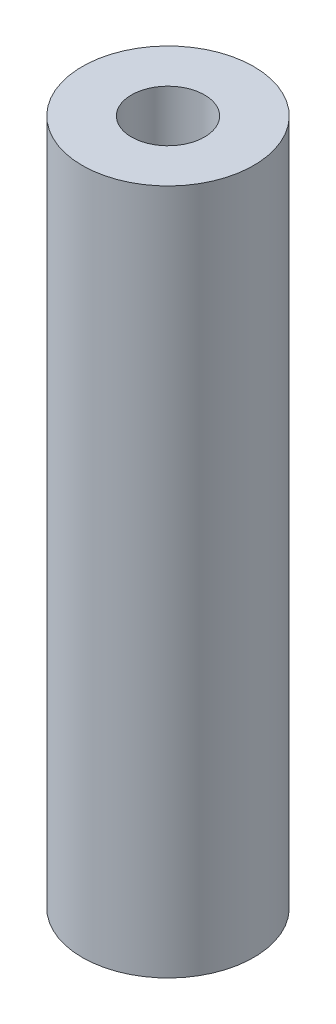
ISO-10303-21;
HEADER;
FILE_DESCRIPTION(('STEP AP214'),'2;1');
FILE_NAME('part.step','',(''),(''),'','','');
FILE_SCHEMA(('AUTOMOTIVE_DESIGN { 1 0 10303 214 1 1 1 1 }'));
ENDSEC;
DATA;
#1=APPLICATION_CONTEXT('core data for automotive mechanical design processes');
#2=APPLICATION_PROTOCOL_DEFINITION('international standard','automotive_design',2000,#1);
#3=PRODUCT_CONTEXT('',#1,'mechanical');
#4=PRODUCT('Part','Part','',(#3));
#5=PRODUCT_RELATED_PRODUCT_CATEGORY('part','',(#4));
#6=PRODUCT_DEFINITION_FORMATION('','',#4);
#7=PRODUCT_DEFINITION_CONTEXT('part definition',#1,'design');
#8=PRODUCT_DEFINITION('design','',#6,#7);
#9=PRODUCT_DEFINITION_SHAPE('','',#8);
#10=(LENGTH_UNIT() NAMED_UNIT(*) SI_UNIT(.MILLI.,.METRE.));
#11=(NAMED_UNIT(*) PLANE_ANGLE_UNIT() SI_UNIT($,.RADIAN.));
#12=(NAMED_UNIT(*) SI_UNIT($,.STERADIAN.) SOLID_ANGLE_UNIT());
#13=UNCERTAINTY_MEASURE_WITH_UNIT(LENGTH_MEASURE(1.E-05),#10,'distance_accuracy_value','');
#14=(GEOMETRIC_REPRESENTATION_CONTEXT(3) GLOBAL_UNCERTAINTY_ASSIGNED_CONTEXT((#13)) GLOBAL_UNIT_ASSIGNED_CONTEXT((#10,
#11,#12)) REPRESENTATION_CONTEXT('',''));
#15=CARTESIAN_POINT('',(0.,0.,0.));
#16=DIRECTION('',(0.,0.,1.));
#17=DIRECTION('',(1.,0.,0.));
#18=AXIS2_PLACEMENT_3D('',#15,#16,#17);
#19=CARTESIAN_POINT('',(0.,25.4,0.));
#20=DIRECTION('',(0.,-1.,0.));
#21=DIRECTION('',(0.,0.,-1.));
#22=AXIS2_PLACEMENT_3D('',#19,#20,#21);
#23=CYLINDRICAL_SURFACE('',#22,3.175);
#24=CARTESIAN_POINT('',(0.,25.4,0.));
#25=DIRECTION('',(0.,1.,0.));
#26=DIRECTION('',(0.,0.,1.));
#27=AXIS2_PLACEMENT_3D('',#24,#25,#26);
#28=CIRCLE('',#27,3.175);
#29=CARTESIAN_POINT('',(0.,25.4,3.175));
#30=VERTEX_POINT('',#29);
#31=EDGE_CURVE('E10',#30,#30,#28,.T.);
#32=ORIENTED_EDGE('',*,*,#31,.F.);
#33=EDGE_LOOP('',(#32));
#34=FACE_BOUND('',#33,.T.);
#35=CARTESIAN_POINT('',(0.,0.,0.));
#36=DIRECTION('',(0.,1.,0.));
#37=DIRECTION('',(0.,0.,1.));
#38=AXIS2_PLACEMENT_3D('',#35,#36,#37);
#39=CIRCLE('',#38,3.175);
#40=CARTESIAN_POINT('',(0.,0.,3.175));
#41=VERTEX_POINT('',#40);
#42=EDGE_CURVE('E34',#41,#41,#39,.T.);
#43=ORIENTED_EDGE('',*,*,#42,.T.);
#44=EDGE_LOOP('',(#43));
#45=FACE_BOUND('',#44,.T.);
#46=ADVANCED_FACE('F31',(#34,#45),#23,.T.);
#47=CARTESIAN_POINT('',(0.,25.4,0.));
#48=DIRECTION('',(0.,1.,0.));
#49=DIRECTION('',(0.,0.,1.));
#50=AXIS2_PLACEMENT_3D('',#47,#48,#49);
#51=PLANE('',#50);
#52=CARTESIAN_POINT('',(0.,25.4,0.));
#53=DIRECTION('',(0.,1.,0.));
#54=DIRECTION('',(0.,0.,1.));
#55=AXIS2_PLACEMENT_3D('',#52,#53,#54);
#56=CIRCLE('',#55,1.35254999999999);
#57=CARTESIAN_POINT('',(0.,25.4,1.35254999999999));
#58=VERTEX_POINT('',#57);
#59=EDGE_CURVE('E45',#58,#58,#56,.T.);
#60=ORIENTED_EDGE('',*,*,#59,.F.);
#61=EDGE_LOOP('',(#60));
#62=FACE_BOUND('',#61,.T.);
#63=ORIENTED_EDGE('',*,*,#31,.T.);
#64=EDGE_LOOP('',(#63));
#65=FACE_BOUND('',#64,.T.);
#66=ADVANCED_FACE('F51',(#62,#65),#51,.T.);
#67=CARTESIAN_POINT('',(0.,0.,0.));
#68=DIRECTION('',(0.,1.,0.));
#69=DIRECTION('',(0.,0.,1.));
#70=AXIS2_PLACEMENT_3D('',#67,#68,#69);
#71=PLANE('',#70);
#72=CARTESIAN_POINT('',(0.,0.,0.));
#73=DIRECTION('',(0.,1.,0.));
#74=DIRECTION('',(0.,0.,1.));
#75=AXIS2_PLACEMENT_3D('',#72,#73,#74);
#76=CIRCLE('',#75,1.35254999999999);
#77=CARTESIAN_POINT('',(0.,0.,1.35254999999999));
#78=VERTEX_POINT('',#77);
#79=EDGE_CURVE('E41',#78,#78,#76,.T.);
#80=ORIENTED_EDGE('',*,*,#79,.T.);
#81=EDGE_LOOP('',(#80));
#82=FACE_BOUND('',#81,.T.);
#83=ORIENTED_EDGE('',*,*,#42,.F.);
#84=EDGE_LOOP('',(#83));
#85=FACE_BOUND('',#84,.T.);
#86=ADVANCED_FACE('F53',(#82,#85),#71,.F.);
#87=CARTESIAN_POINT('',(0.,25.4,0.));
#88=DIRECTION('',(0.,1.,0.));
#89=DIRECTION('',(0.,0.,1.));
#90=AXIS2_PLACEMENT_3D('',#87,#88,#89);
#91=CYLINDRICAL_SURFACE('',#90,1.35254999999999);
#92=ORIENTED_EDGE('',*,*,#79,.F.);
#93=EDGE_LOOP('',(#92));
#94=FACE_BOUND('',#93,.T.);
#95=ORIENTED_EDGE('',*,*,#59,.T.);
#96=EDGE_LOOP('',(#95));
#97=FACE_BOUND('',#96,.T.);
#98=ADVANCED_FACE('F49',(#94,#97),#91,.F.);
#99=CLOSED_SHELL('',(#46,#66,#86,#98));
#100=MANIFOLD_SOLID_BREP('B2',#99);
#101=ADVANCED_BREP_SHAPE_REPRESENTATION('',(#18,#100),#14);
#102=SHAPE_DEFINITION_REPRESENTATION(#9,#101);
ENDSEC;
END-ISO-10303-21;
